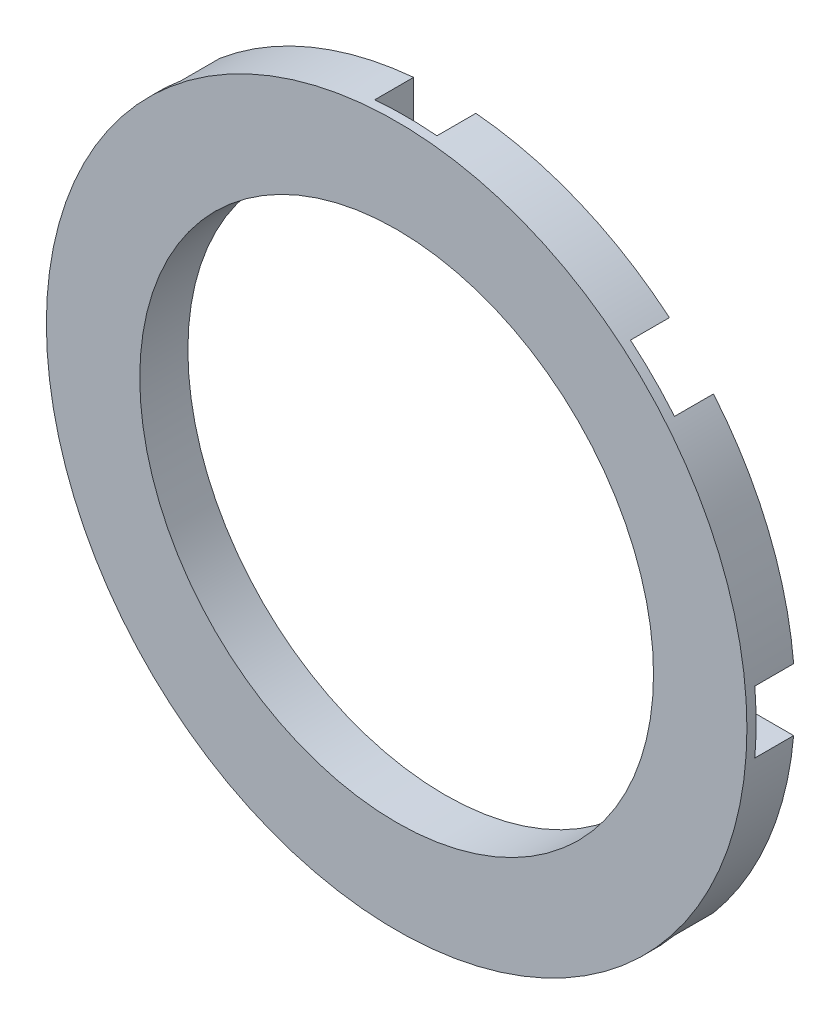
ISO-10303-21;
HEADER;
FILE_DESCRIPTION(('STEP AP214'),'2;1');
FILE_NAME('part.step','',(''),(''),'','','');
FILE_SCHEMA(('AUTOMOTIVE_DESIGN { 1 0 10303 214 1 1 1 1 }'));
ENDSEC;
DATA;
#1=APPLICATION_CONTEXT('core data for automotive mechanical design processes');
#2=APPLICATION_PROTOCOL_DEFINITION('international standard','automotive_design',2000,#1);
#3=PRODUCT_CONTEXT('',#1,'mechanical');
#4=PRODUCT('Part','Part','',(#3));
#5=PRODUCT_RELATED_PRODUCT_CATEGORY('part','',(#4));
#6=PRODUCT_DEFINITION_FORMATION('','',#4);
#7=PRODUCT_DEFINITION_CONTEXT('part definition',#1,'design');
#8=PRODUCT_DEFINITION('design','',#6,#7);
#9=PRODUCT_DEFINITION_SHAPE('','',#8);
#10=(LENGTH_UNIT() NAMED_UNIT(*) SI_UNIT(.MILLI.,.METRE.));
#11=(NAMED_UNIT(*) PLANE_ANGLE_UNIT() SI_UNIT($,.RADIAN.));
#12=(NAMED_UNIT(*) SI_UNIT($,.STERADIAN.) SOLID_ANGLE_UNIT());
#13=UNCERTAINTY_MEASURE_WITH_UNIT(LENGTH_MEASURE(1.E-05),#10,'distance_accuracy_value','');
#14=(GEOMETRIC_REPRESENTATION_CONTEXT(3) GLOBAL_UNCERTAINTY_ASSIGNED_CONTEXT((#13)) GLOBAL_UNIT_ASSIGNED_CONTEXT((#10,
#11,#12)) REPRESENTATION_CONTEXT('',''));
#15=CARTESIAN_POINT('',(0.,0.,0.));
#16=DIRECTION('',(0.,0.,1.));
#17=DIRECTION('',(1.,0.,0.));
#18=AXIS2_PLACEMENT_3D('',#15,#16,#17);
#19=CARTESIAN_POINT('',(0.,0.,-1.96215));
#20=DIRECTION('',(0.,0.,1.));
#21=DIRECTION('',(1.,0.,0.));
#22=AXIS2_PLACEMENT_3D('',#19,#20,#21);
#23=PLANE('',#22);
#24=CARTESIAN_POINT('',(0.,0.,-1.96215));
#25=DIRECTION('',(0.,0.,1.));
#26=DIRECTION('',(1.,0.,0.));
#27=AXIS2_PLACEMENT_3D('',#24,#25,#26);
#28=CIRCLE('',#27,28.575);
#29=CARTESIAN_POINT('',(18.3295422452963,21.9216446937245,-1.96215));
#30=VERTEX_POINT('',#29);
#31=CARTESIAN_POINT('',(2.54,28.461887235389,-1.96215));
#32=VERTEX_POINT('',#31);
#33=EDGE_CURVE('E48',#30,#32,#28,.T.);
#34=ORIENTED_EDGE('',*,*,#33,.F.);
#35=DIRECTION('',(0.707106781186539,0.707106781186556,0.));
#36=VECTOR('',#35,1.);
#37=CARTESIAN_POINT('',(20.2055762724053,23.7976787208335,-1.96215));
#38=LINE('',#37,#36);
#39=CARTESIAN_POINT('',(16.0744328207132,19.6665352691413,-1.96215));
#40=VERTEX_POINT('',#39);
#41=EDGE_CURVE('E254',#40,#30,#38,.T.);
#42=ORIENTED_EDGE('',*,*,#41,.F.);
#43=CARTESIAN_POINT('',(0.,0.,-1.96215));
#44=DIRECTION('',(0.,0.,-1.));
#45=DIRECTION('',(-1.,0.,0.));
#46=AXIS2_PLACEMENT_3D('',#43,#44,#45);
#47=CIRCLE('',#46,25.4);
#48=CARTESIAN_POINT('',(2.54,25.2726809025081,-1.96215));
#49=VERTEX_POINT('',#48);
#50=EDGE_CURVE('E263',#49,#40,#47,.T.);
#51=ORIENTED_EDGE('',*,*,#50,.F.);
#52=DIRECTION('',(0.,-1.,0.));
#53=VECTOR('',#52,1.);
#54=CARTESIAN_POINT('',(2.54,31.115,-1.96215));
#55=LINE('',#54,#53);
#56=EDGE_CURVE('E320',#32,#49,#55,.T.);
#57=ORIENTED_EDGE('',*,*,#56,.F.);
#58=EDGE_LOOP('',(#34,#42,#51,#57));
#59=FACE_BOUND('',#58,.T.);
#60=ADVANCED_FACE('F39',(#59),#23,.F.);
#61=CARTESIAN_POINT('',(0.,0.,1.21285));
#62=DIRECTION('',(0.,0.,-1.));
#63=DIRECTION('',(-1.,0.,0.));
#64=AXIS2_PLACEMENT_3D('',#61,#62,#63);
#65=CYLINDRICAL_SURFACE('',#64,25.4);
#66=ORIENTED_EDGE('',*,*,#50,.T.);
#67=DIRECTION('',(0.,0.,-1.));
#68=VECTOR('',#67,1.);
#69=CARTESIAN_POINT('',(16.0744328207132,19.6665352691413,1.21285));
#70=LINE('',#69,#68);
#71=CARTESIAN_POINT('',(16.0744328207132,19.6665352691413,1.21285));
#72=VERTEX_POINT('',#71);
#73=EDGE_CURVE('E248',#40,#72,#70,.F.);
#74=ORIENTED_EDGE('',*,*,#73,.T.);
#75=CARTESIAN_POINT('',(0.,0.,1.21285));
#76=DIRECTION('',(0.,0.,-1.));
#77=DIRECTION('',(-1.,0.,0.));
#78=AXIS2_PLACEMENT_3D('',#75,#76,#77);
#79=CIRCLE('',#78,25.4);
#80=CARTESIAN_POINT('',(2.54,25.2726809025081,1.21285));
#81=VERTEX_POINT('',#80);
#82=EDGE_CURVE('E261',#81,#72,#79,.T.);
#83=ORIENTED_EDGE('',*,*,#82,.F.);
#84=DIRECTION('',(0.,0.,-1.));
#85=VECTOR('',#84,1.);
#86=CARTESIAN_POINT('',(2.54,25.2726809025081,1.21285));
#87=LINE('',#86,#85);
#88=EDGE_CURVE('E311',#81,#49,#87,.T.);
#89=ORIENTED_EDGE('',*,*,#88,.T.);
#90=EDGE_LOOP('',(#66,#74,#83,#89));
#91=FACE_BOUND('',#90,.T.);
#92=ADVANCED_FACE('F259',(#91),#65,.F.);
#93=CARTESIAN_POINT('',(19.6665352691409,16.0744328207137,-1.96215));
#94=VERTEX_POINT('',#93);
#95=CARTESIAN_POINT('',(25.2726809025081,2.54000000000026,-1.96215));
#96=VERTEX_POINT('',#95);
#97=EDGE_CURVE('E286',#94,#96,#47,.T.);
#98=ORIENTED_EDGE('',*,*,#97,.F.);
#99=DIRECTION('',(-0.707106781186539,-0.707106781186556,0.));
#100=VECTOR('',#99,1.);
#101=CARTESIAN_POINT('',(23.797678720833,20.2055762724059,-1.96215));
#102=LINE('',#101,#100);
#103=CARTESIAN_POINT('',(21.921644693724,18.3295422452968,-1.96215));
#104=VERTEX_POINT('',#103);
#105=EDGE_CURVE('E472',#104,#94,#102,.T.);
#106=ORIENTED_EDGE('',*,*,#105,.F.);
#107=CARTESIAN_POINT('',(28.461887235389,2.5400000000003,-1.96215));
#108=VERTEX_POINT('',#107);
#109=EDGE_CURVE('E488',#108,#104,#28,.T.);
#110=ORIENTED_EDGE('',*,*,#109,.F.);
#111=DIRECTION('',(1.,0.,0.));
#112=VECTOR('',#111,1.);
#113=CARTESIAN_POINT('',(31.115,2.54000000000032,-1.96215));
#114=LINE('',#113,#112);
#115=EDGE_CURVE('E457',#96,#108,#114,.T.);
#116=ORIENTED_EDGE('',*,*,#115,.F.);
#117=EDGE_LOOP('',(#98,#106,#110,#116));
#118=FACE_BOUND('',#117,.T.);
#119=ADVANCED_FACE('F487',(#118),#23,.F.);
#120=CARTESIAN_POINT('',(19.6665352691409,16.0744328207137,1.21285));
#121=VERTEX_POINT('',#120);
#122=CARTESIAN_POINT('',(25.2726809025081,2.54000000000026,1.21285));
#123=VERTEX_POINT('',#122);
#124=EDGE_CURVE('E272',#121,#123,#79,.T.);
#125=ORIENTED_EDGE('',*,*,#124,.F.);
#126=DIRECTION('',(0.,0.,-1.));
#127=VECTOR('',#126,1.);
#128=CARTESIAN_POINT('',(19.6665352691409,16.0744328207137,1.21285));
#129=LINE('',#128,#127);
#130=EDGE_CURVE('E462',#121,#94,#129,.T.);
#131=ORIENTED_EDGE('',*,*,#130,.T.);
#132=ORIENTED_EDGE('',*,*,#97,.T.);
#133=DIRECTION('',(0.,0.,-1.));
#134=VECTOR('',#133,1.);
#135=CARTESIAN_POINT('',(25.2726809025081,2.54000000000026,1.21285));
#136=LINE('',#135,#134);
#137=EDGE_CURVE('E439',#96,#123,#136,.F.);
#138=ORIENTED_EDGE('',*,*,#137,.T.);
#139=EDGE_LOOP('',(#125,#131,#132,#138));
#140=FACE_BOUND('',#139,.T.);
#141=ADVANCED_FACE('F484',(#140),#65,.F.);
#142=CARTESIAN_POINT('',(25.2726809025082,-2.53999999999973,-1.96215));
#143=VERTEX_POINT('',#142);
#144=CARTESIAN_POINT('',(19.6665352691412,-16.0744328207133,-1.96215));
#145=VERTEX_POINT('',#144);
#146=EDGE_CURVE('E288',#143,#145,#47,.T.);
#147=ORIENTED_EDGE('',*,*,#146,.F.);
#148=DIRECTION('',(-1.,0.,0.));
#149=VECTOR('',#148,1.);
#150=CARTESIAN_POINT('',(31.115,-2.53999999999967,-1.96215));
#151=LINE('',#150,#149);
#152=CARTESIAN_POINT('',(28.461887235389,-2.5399999999997,-1.96215));
#153=VERTEX_POINT('',#152);
#154=EDGE_CURVE('E264',#153,#143,#151,.T.);
#155=ORIENTED_EDGE('',*,*,#154,.F.);
#156=CARTESIAN_POINT('',(21.9216446937244,-18.3295422452964,-1.96215));
#157=VERTEX_POINT('',#156);
#158=EDGE_CURVE('E541',#157,#153,#28,.T.);
#159=ORIENTED_EDGE('',*,*,#158,.F.);
#160=DIRECTION('',(0.707106781186553,-0.707106781186542,0.));
#161=VECTOR('',#160,1.);
#162=CARTESIAN_POINT('',(23.7976787208334,-20.2055762724054,-1.96215));
#163=LINE('',#162,#161);
#164=EDGE_CURVE('E435',#145,#157,#163,.T.);
#165=ORIENTED_EDGE('',*,*,#164,.F.);
#166=EDGE_LOOP('',(#147,#155,#159,#165));
#167=FACE_BOUND('',#166,.T.);
#168=ADVANCED_FACE('F507',(#167),#23,.F.);
#169=CARTESIAN_POINT('',(25.2726809025082,-2.53999999999973,1.21285));
#170=VERTEX_POINT('',#169);
#171=CARTESIAN_POINT('',(19.6665352691412,-16.0744328207133,1.21285));
#172=VERTEX_POINT('',#171);
#173=EDGE_CURVE('E278',#170,#172,#79,.T.);
#174=ORIENTED_EDGE('',*,*,#173,.F.);
#175=DIRECTION('',(0.,0.,-1.));
#176=VECTOR('',#175,1.);
#177=CARTESIAN_POINT('',(25.2726809025082,-2.53999999999973,1.21285));
#178=LINE('',#177,#176);
#179=EDGE_CURVE('E446',#170,#143,#178,.T.);
#180=ORIENTED_EDGE('',*,*,#179,.T.);
#181=ORIENTED_EDGE('',*,*,#146,.T.);
#182=DIRECTION('',(0.,0.,-1.));
#183=VECTOR('',#182,1.);
#184=CARTESIAN_POINT('',(19.6665352691412,-16.0744328207133,1.21285));
#185=LINE('',#184,#183);
#186=EDGE_CURVE('E415',#145,#172,#185,.F.);
#187=ORIENTED_EDGE('',*,*,#186,.T.);
#188=EDGE_LOOP('',(#174,#180,#181,#187));
#189=FACE_BOUND('',#188,.T.);
#190=ADVANCED_FACE('F503',(#189),#65,.F.);
#191=CARTESIAN_POINT('',(16.0744328207136,-19.666535269141,-1.96215));
#192=VERTEX_POINT('',#191);
#193=CARTESIAN_POINT('',(2.54,-25.2726809025081,-1.96215));
#194=VERTEX_POINT('',#193);
#195=EDGE_CURVE('E509',#192,#194,#47,.T.);
#196=ORIENTED_EDGE('',*,*,#195,.F.);
#197=DIRECTION('',(-0.707106781186553,0.707106781186542,0.));
#198=VECTOR('',#197,1.);
#199=CARTESIAN_POINT('',(20.2055762724058,-23.7976787208331,-1.96215));
#200=LINE('',#199,#198);
#201=CARTESIAN_POINT('',(18.3295422452968,-21.9216446937241,-1.96215));
#202=VERTEX_POINT('',#201);
#203=EDGE_CURVE('E437',#202,#192,#200,.T.);
#204=ORIENTED_EDGE('',*,*,#203,.F.);
#205=CARTESIAN_POINT('',(2.54,-28.461887235389,-1.96215));
#206=VERTEX_POINT('',#205);
#207=EDGE_CURVE('E536',#206,#202,#28,.T.);
#208=ORIENTED_EDGE('',*,*,#207,.F.);
#209=DIRECTION('',(0.,-1.,0.));
#210=VECTOR('',#209,1.);
#211=CARTESIAN_POINT('',(2.54,-31.115,-1.96215));
#212=LINE('',#211,#210);
#213=EDGE_CURVE('E411',#194,#206,#212,.T.);
#214=ORIENTED_EDGE('',*,*,#213,.F.);
#215=EDGE_LOOP('',(#196,#204,#208,#214));
#216=FACE_BOUND('',#215,.T.);
#217=ADVANCED_FACE('F582',(#216),#23,.F.);
#218=CARTESIAN_POINT('',(16.0744328207136,-19.666535269141,1.21285));
#219=VERTEX_POINT('',#218);
#220=CARTESIAN_POINT('',(2.54,-25.2726809025081,1.21285));
#221=VERTEX_POINT('',#220);
#222=EDGE_CURVE('E913',#219,#221,#79,.T.);
#223=ORIENTED_EDGE('',*,*,#222,.F.);
#224=DIRECTION('',(0.,0.,-1.));
#225=VECTOR('',#224,1.);
#226=CARTESIAN_POINT('',(16.0744328207136,-19.666535269141,1.21285));
#227=LINE('',#226,#225);
#228=EDGE_CURVE('E423',#219,#192,#227,.T.);
#229=ORIENTED_EDGE('',*,*,#228,.T.);
#230=ORIENTED_EDGE('',*,*,#195,.T.);
#231=DIRECTION('',(0.,0.,-1.));
#232=VECTOR('',#231,1.);
#233=CARTESIAN_POINT('',(2.54,-25.2726809025081,1.21285));
#234=LINE('',#233,#232);
#235=EDGE_CURVE('E391',#194,#221,#234,.F.);
#236=ORIENTED_EDGE('',*,*,#235,.T.);
#237=EDGE_LOOP('',(#223,#229,#230,#236));
#238=FACE_BOUND('',#237,.T.);
#239=ADVANCED_FACE('F586',(#238),#65,.F.);
#240=CARTESIAN_POINT('',(-2.54,-25.2726809025081,-1.96215));
#241=VERTEX_POINT('',#240);
#242=CARTESIAN_POINT('',(-16.0744328207133,-19.6665352691412,-1.96215));
#243=VERTEX_POINT('',#242);
#244=EDGE_CURVE('E510',#241,#243,#47,.T.);
#245=ORIENTED_EDGE('',*,*,#244,.F.);
#246=DIRECTION('',(0.,1.,0.));
#247=VECTOR('',#246,1.);
#248=CARTESIAN_POINT('',(-2.54,-31.115,-1.96215));
#249=LINE('',#248,#247);
#250=CARTESIAN_POINT('',(-2.54,-28.461887235389,-1.96215));
#251=VERTEX_POINT('',#250);
#252=EDGE_CURVE('E413',#251,#241,#249,.T.);
#253=ORIENTED_EDGE('',*,*,#252,.F.);
#254=CARTESIAN_POINT('',(-18.3295422452965,-21.9216446937243,-1.96215));
#255=VERTEX_POINT('',#254);
#256=EDGE_CURVE('E533',#255,#251,#28,.T.);
#257=ORIENTED_EDGE('',*,*,#256,.F.);
#258=DIRECTION('',(-0.707106781186544,-0.707106781186551,0.));
#259=VECTOR('',#258,1.);
#260=CARTESIAN_POINT('',(-20.2055762724055,-23.7976787208334,-1.96215));
#261=LINE('',#260,#259);
#262=EDGE_CURVE('E387',#243,#255,#261,.T.);
#263=ORIENTED_EDGE('',*,*,#262,.F.);
#264=EDGE_LOOP('',(#245,#253,#257,#263));
#265=FACE_BOUND('',#264,.T.);
#266=ADVANCED_FACE('F589',(#265),#23,.F.);
#267=CARTESIAN_POINT('',(-2.54,-25.2726809025081,1.21285));
#268=VERTEX_POINT('',#267);
#269=CARTESIAN_POINT('',(-16.0744328207133,-19.6665352691412,1.21285));
#270=VERTEX_POINT('',#269);
#271=EDGE_CURVE('E914',#268,#270,#79,.T.);
#272=ORIENTED_EDGE('',*,*,#271,.F.);
#273=DIRECTION('',(0.,0.,-1.));
#274=VECTOR('',#273,1.);
#275=CARTESIAN_POINT('',(-2.54,-25.2726809025081,1.21285));
#276=LINE('',#275,#274);
#277=EDGE_CURVE('E399',#268,#241,#276,.T.);
#278=ORIENTED_EDGE('',*,*,#277,.T.);
#279=ORIENTED_EDGE('',*,*,#244,.T.);
#280=DIRECTION('',(0.,0.,-1.));
#281=VECTOR('',#280,1.);
#282=CARTESIAN_POINT('',(-16.0744328207133,-19.6665352691412,1.21285));
#283=LINE('',#282,#281);
#284=EDGE_CURVE('E367',#243,#270,#283,.F.);
#285=ORIENTED_EDGE('',*,*,#284,.T.);
#286=EDGE_LOOP('',(#272,#278,#279,#285));
#287=FACE_BOUND('',#286,.T.);
#288=ADVANCED_FACE('F593',(#287),#65,.F.);
#289=CARTESIAN_POINT('',(-19.666535269141,-16.0744328207135,-1.96215));
#290=VERTEX_POINT('',#289);
#291=CARTESIAN_POINT('',(-25.2726809025081,-2.54000000000009,-1.96215));
#292=VERTEX_POINT('',#291);
#293=EDGE_CURVE('E296',#290,#292,#47,.T.);
#294=ORIENTED_EDGE('',*,*,#293,.F.);
#295=DIRECTION('',(0.707106781186544,0.707106781186551,0.));
#296=VECTOR('',#295,1.);
#297=CARTESIAN_POINT('',(-23.7976787208332,-20.2055762724057,-1.96215));
#298=LINE('',#297,#296);
#299=CARTESIAN_POINT('',(-21.9216446937241,-18.3295422452967,-1.96215));
#300=VERTEX_POINT('',#299);
#301=EDGE_CURVE('E389',#300,#290,#298,.T.);
#302=ORIENTED_EDGE('',*,*,#301,.F.);
#303=CARTESIAN_POINT('',(-28.461887235389,-2.5400000000001,-1.96215));
#304=VERTEX_POINT('',#303);
#305=EDGE_CURVE('E531',#304,#300,#28,.T.);
#306=ORIENTED_EDGE('',*,*,#305,.F.);
#307=DIRECTION('',(-1.,0.,0.));
#308=VECTOR('',#307,1.);
#309=CARTESIAN_POINT('',(-31.115,-2.54000000000011,-1.96215));
#310=LINE('',#309,#308);
#311=EDGE_CURVE('E363',#292,#304,#310,.T.);
#312=ORIENTED_EDGE('',*,*,#311,.F.);
#313=EDGE_LOOP('',(#294,#302,#306,#312));
#314=FACE_BOUND('',#313,.T.);
#315=ADVANCED_FACE('F529',(#314),#23,.F.);
#316=CARTESIAN_POINT('',(-19.666535269141,-16.0744328207135,1.21285));
#317=VERTEX_POINT('',#316);
#318=CARTESIAN_POINT('',(-25.2726809025081,-2.54000000000009,1.21285));
#319=VERTEX_POINT('',#318);
#320=EDGE_CURVE('E285',#317,#319,#79,.T.);
#321=ORIENTED_EDGE('',*,*,#320,.F.);
#322=DIRECTION('',(0.,0.,-1.));
#323=VECTOR('',#322,1.);
#324=CARTESIAN_POINT('',(-19.666535269141,-16.0744328207135,1.21285));
#325=LINE('',#324,#323);
#326=EDGE_CURVE('E375',#317,#290,#325,.T.);
#327=ORIENTED_EDGE('',*,*,#326,.T.);
#328=ORIENTED_EDGE('',*,*,#293,.T.);
#329=DIRECTION('',(0.,0.,-1.));
#330=VECTOR('',#329,1.);
#331=CARTESIAN_POINT('',(-25.2726809025081,-2.54000000000009,1.21285));
#332=LINE('',#331,#330);
#333=EDGE_CURVE('E343',#292,#319,#332,.F.);
#334=ORIENTED_EDGE('',*,*,#333,.T.);
#335=EDGE_LOOP('',(#321,#327,#328,#334));
#336=FACE_BOUND('',#335,.T.);
#337=ADVANCED_FACE('F521',(#336),#65,.F.);
#338=CARTESIAN_POINT('',(-25.2726809025082,2.53999999999991,-1.96215));
#339=VERTEX_POINT('',#338);
#340=CARTESIAN_POINT('',(-19.6665352691411,16.0744328207134,-1.96215));
#341=VERTEX_POINT('',#340);
#342=EDGE_CURVE('E289',#339,#341,#47,.T.);
#343=ORIENTED_EDGE('',*,*,#342,.F.);
#344=DIRECTION('',(1.,0.,0.));
#345=VECTOR('',#344,1.);
#346=CARTESIAN_POINT('',(-31.115,2.53999999999989,-1.96215));
#347=LINE('',#346,#345);
#348=CARTESIAN_POINT('',(-28.461887235389,2.5399999999999,-1.96215));
#349=VERTEX_POINT('',#348);
#350=EDGE_CURVE('E365',#349,#339,#347,.T.);
#351=ORIENTED_EDGE('',*,*,#350,.F.);
#352=CARTESIAN_POINT('',(-21.9216446937243,18.3295422452965,-1.96215));
#353=VERTEX_POINT('',#352);
#354=EDGE_CURVE('E47',#353,#349,#28,.T.);
#355=ORIENTED_EDGE('',*,*,#354,.F.);
#356=DIRECTION('',(-0.707106781186549,0.707106781186547,0.));
#357=VECTOR('',#356,1.);
#358=CARTESIAN_POINT('',(-23.7976787208333,20.2055762724056,-1.96215));
#359=LINE('',#358,#357);
#360=EDGE_CURVE('E339',#341,#353,#359,.T.);
#361=ORIENTED_EDGE('',*,*,#360,.F.);
#362=EDGE_LOOP('',(#343,#351,#355,#361));
#363=FACE_BOUND('',#362,.T.);
#364=ADVANCED_FACE('F568',(#363),#23,.F.);
#365=CARTESIAN_POINT('',(-25.2726809025082,2.53999999999991,1.21285));
#366=VERTEX_POINT('',#365);
#367=CARTESIAN_POINT('',(-19.6665352691411,16.0744328207134,1.21285));
#368=VERTEX_POINT('',#367);
#369=EDGE_CURVE('E281',#366,#368,#79,.T.);
#370=ORIENTED_EDGE('',*,*,#369,.F.);
#371=DIRECTION('',(0.,0.,-1.));
#372=VECTOR('',#371,1.);
#373=CARTESIAN_POINT('',(-25.2726809025082,2.53999999999991,1.21285));
#374=LINE('',#373,#372);
#375=EDGE_CURVE('E351',#366,#339,#374,.T.);
#376=ORIENTED_EDGE('',*,*,#375,.T.);
#377=ORIENTED_EDGE('',*,*,#342,.T.);
#378=DIRECTION('',(0.,0.,-1.));
#379=VECTOR('',#378,1.);
#380=CARTESIAN_POINT('',(-19.6665352691411,16.0744328207134,1.21285));
#381=LINE('',#380,#379);
#382=EDGE_CURVE('E325',#341,#368,#381,.F.);
#383=ORIENTED_EDGE('',*,*,#382,.T.);
#384=EDGE_LOOP('',(#370,#376,#377,#383));
#385=FACE_BOUND('',#384,.T.);
#386=ADVANCED_FACE('F567',(#385),#65,.F.);
#387=CARTESIAN_POINT('',(0.,0.,-1.96215));
#388=DIRECTION('',(0.,0.,1.));
#389=DIRECTION('',(1.,0.,0.));
#390=AXIS2_PLACEMENT_3D('',#387,#388,#389);
#391=CIRCLE('',#390,20.955);
#392=CARTESIAN_POINT('',(20.955,0.,-1.96215));
#393=VERTEX_POINT('',#392);
#394=EDGE_CURVE('E546',#393,#393,#391,.T.);
#395=ORIENTED_EDGE('',*,*,#394,.T.);
#396=EDGE_LOOP('',(#395));
#397=FACE_BOUND('',#396,.T.);
#398=CARTESIAN_POINT('',(0.,0.,-1.96215));
#399=DIRECTION('',(0.,0.,-1.));
#400=DIRECTION('',(-1.,0.,0.));
#401=AXIS2_PLACEMENT_3D('',#398,#399,#400);
#402=CIRCLE('',#401,22.225);
#403=CARTESIAN_POINT('',(-22.225,0.,-1.96215));
#404=VERTEX_POINT('',#403);
#405=EDGE_CURVE('E298',#404,#404,#402,.T.);
#406=ORIENTED_EDGE('',*,*,#405,.T.);
#407=EDGE_LOOP('',(#406));
#408=FACE_BOUND('',#407,.T.);
#409=ADVANCED_FACE('F560',(#397,#408),#23,.F.);
#410=CARTESIAN_POINT('',(0.,0.,-1.96215));
#411=DIRECTION('',(0.,0.,1.));
#412=DIRECTION('',(1.,0.,0.));
#413=AXIS2_PLACEMENT_3D('',#410,#411,#412);
#414=CYLINDRICAL_SURFACE('',#413,28.575);
#415=DIRECTION('',(0.,0.,1.));
#416=VECTOR('',#415,1.);
#417=CARTESIAN_POINT('',(18.3295422452963,21.9216446937245,-1.96215));
#418=LINE('',#417,#416);
#419=CARTESIAN_POINT('',(18.3295422452963,21.9216446937245,1.21285));
#420=VERTEX_POINT('',#419);
#421=EDGE_CURVE('E251',#30,#420,#418,.T.);
#422=ORIENTED_EDGE('',*,*,#421,.F.);
#423=ORIENTED_EDGE('',*,*,#33,.T.);
#424=DIRECTION('',(0.,0.,1.));
#425=VECTOR('',#424,1.);
#426=CARTESIAN_POINT('',(2.54,28.461887235389,-1.96215));
#427=LINE('',#426,#425);
#428=CARTESIAN_POINT('',(2.54,28.461887235389,1.21285));
#429=VERTEX_POINT('',#428);
#430=EDGE_CURVE('E308',#429,#32,#427,.F.);
#431=ORIENTED_EDGE('',*,*,#430,.F.);
#432=CARTESIAN_POINT('',(0.,0.,1.21285));
#433=DIRECTION('',(0.,0.,-1.));
#434=DIRECTION('',(-1.,0.,0.));
#435=AXIS2_PLACEMENT_3D('',#432,#433,#434);
#436=CIRCLE('',#435,28.575);
#437=CARTESIAN_POINT('',(-2.54,28.461887235389,1.21285));
#438=VERTEX_POINT('',#437);
#439=EDGE_CURVE('E313',#429,#438,#436,.F.);
#440=ORIENTED_EDGE('',*,*,#439,.T.);
#441=DIRECTION('',(0.,0.,1.));
#442=VECTOR('',#441,1.);
#443=CARTESIAN_POINT('',(-2.54,28.461887235389,-1.96215));
#444=LINE('',#443,#442);
#445=CARTESIAN_POINT('',(-2.54,28.461887235389,-1.96215));
#446=VERTEX_POINT('',#445);
#447=EDGE_CURVE('E303',#446,#438,#444,.T.);
#448=ORIENTED_EDGE('',*,*,#447,.F.);
#449=CARTESIAN_POINT('',(-18.3295422452966,21.9216446937242,-1.96215));
#450=VERTEX_POINT('',#449);
#451=EDGE_CURVE('E11',#446,#450,#28,.T.);
#452=ORIENTED_EDGE('',*,*,#451,.T.);
#453=DIRECTION('',(0.,0.,1.));
#454=VECTOR('',#453,1.);
#455=CARTESIAN_POINT('',(-18.3295422452966,21.9216446937242,-1.96215));
#456=LINE('',#455,#454);
#457=CARTESIAN_POINT('',(-18.3295422452966,21.9216446937242,1.21285));
#458=VERTEX_POINT('',#457);
#459=EDGE_CURVE('E328',#458,#450,#456,.F.);
#460=ORIENTED_EDGE('',*,*,#459,.F.);
#461=CARTESIAN_POINT('',(0.,0.,1.21285));
#462=DIRECTION('',(0.,0.,-1.));
#463=DIRECTION('',(-1.,0.,0.));
#464=AXIS2_PLACEMENT_3D('',#461,#462,#463);
#465=CIRCLE('',#464,28.575);
#466=CARTESIAN_POINT('',(-21.9216446937243,18.3295422452965,1.21285));
#467=VERTEX_POINT('',#466);
#468=EDGE_CURVE('E332',#458,#467,#465,.F.);
#469=ORIENTED_EDGE('',*,*,#468,.T.);
#470=DIRECTION('',(0.,0.,1.));
#471=VECTOR('',#470,1.);
#472=CARTESIAN_POINT('',(-21.9216446937243,18.3295422452965,-1.96215));
#473=LINE('',#472,#471);
#474=EDGE_CURVE('E322',#353,#467,#473,.T.);
#475=ORIENTED_EDGE('',*,*,#474,.F.);
#476=ORIENTED_EDGE('',*,*,#354,.T.);
#477=DIRECTION('',(0.,0.,1.));
#478=VECTOR('',#477,1.);
#479=CARTESIAN_POINT('',(-28.461887235389,2.5399999999999,-1.96215));
#480=LINE('',#479,#478);
#481=CARTESIAN_POINT('',(-28.461887235389,2.5399999999999,1.21285));
#482=VERTEX_POINT('',#481);
#483=EDGE_CURVE('E354',#482,#349,#480,.F.);
#484=ORIENTED_EDGE('',*,*,#483,.F.);
#485=CARTESIAN_POINT('',(0.,0.,1.21285));
#486=DIRECTION('',(0.,0.,-1.));
#487=DIRECTION('',(-1.,0.,0.));
#488=AXIS2_PLACEMENT_3D('',#485,#486,#487);
#489=CIRCLE('',#488,28.575);
#490=CARTESIAN_POINT('',(-28.461887235389,-2.5400000000001,1.21285));
#491=VERTEX_POINT('',#490);
#492=EDGE_CURVE('E356',#482,#491,#489,.F.);
#493=ORIENTED_EDGE('',*,*,#492,.T.);
#494=DIRECTION('',(0.,0.,1.));
#495=VECTOR('',#494,1.);
#496=CARTESIAN_POINT('',(-28.461887235389,-2.5400000000001,-1.96215));
#497=LINE('',#496,#495);
#498=EDGE_CURVE('E348',#304,#491,#497,.T.);
#499=ORIENTED_EDGE('',*,*,#498,.F.);
#500=ORIENTED_EDGE('',*,*,#305,.T.);
#501=DIRECTION('',(0.,0.,1.));
#502=VECTOR('',#501,1.);
#503=CARTESIAN_POINT('',(-21.9216446937241,-18.3295422452967,-1.96215));
#504=LINE('',#503,#502);
#505=CARTESIAN_POINT('',(-21.9216446937241,-18.3295422452967,1.21285));
#506=VERTEX_POINT('',#505);
#507=EDGE_CURVE('E378',#506,#300,#504,.F.);
#508=ORIENTED_EDGE('',*,*,#507,.F.);
#509=CARTESIAN_POINT('',(0.,0.,1.21285));
#510=DIRECTION('',(0.,0.,-1.));
#511=DIRECTION('',(-1.,0.,0.));
#512=AXIS2_PLACEMENT_3D('',#509,#510,#511);
#513=CIRCLE('',#512,28.575);
#514=CARTESIAN_POINT('',(-18.3295422452965,-21.9216446937243,1.21285));
#515=VERTEX_POINT('',#514);
#516=EDGE_CURVE('E380',#506,#515,#513,.F.);
#517=ORIENTED_EDGE('',*,*,#516,.T.);
#518=DIRECTION('',(0.,0.,1.));
#519=VECTOR('',#518,1.);
#520=CARTESIAN_POINT('',(-18.3295422452965,-21.9216446937243,-1.96215));
#521=LINE('',#520,#519);
#522=EDGE_CURVE('E372',#255,#515,#521,.T.);
#523=ORIENTED_EDGE('',*,*,#522,.F.);
#524=ORIENTED_EDGE('',*,*,#256,.T.);
#525=DIRECTION('',(0.,0.,1.));
#526=VECTOR('',#525,1.);
#527=CARTESIAN_POINT('',(-2.54,-28.461887235389,-1.96215));
#528=LINE('',#527,#526);
#529=CARTESIAN_POINT('',(-2.54,-28.461887235389,1.21285));
#530=VERTEX_POINT('',#529);
#531=EDGE_CURVE('E402',#530,#251,#528,.F.);
#532=ORIENTED_EDGE('',*,*,#531,.F.);
#533=CARTESIAN_POINT('',(0.,0.,1.21285));
#534=DIRECTION('',(0.,0.,-1.));
#535=DIRECTION('',(-1.,0.,0.));
#536=AXIS2_PLACEMENT_3D('',#533,#534,#535);
#537=CIRCLE('',#536,28.575);
#538=CARTESIAN_POINT('',(2.54,-28.461887235389,1.21285));
#539=VERTEX_POINT('',#538);
#540=EDGE_CURVE('E404',#530,#539,#537,.F.);
#541=ORIENTED_EDGE('',*,*,#540,.T.);
#542=DIRECTION('',(0.,0.,1.));
#543=VECTOR('',#542,1.);
#544=CARTESIAN_POINT('',(2.54,-28.461887235389,-1.96215));
#545=LINE('',#544,#543);
#546=EDGE_CURVE('E396',#206,#539,#545,.T.);
#547=ORIENTED_EDGE('',*,*,#546,.F.);
#548=ORIENTED_EDGE('',*,*,#207,.T.);
#549=DIRECTION('',(0.,0.,1.));
#550=VECTOR('',#549,1.);
#551=CARTESIAN_POINT('',(18.3295422452968,-21.9216446937241,-1.96215));
#552=LINE('',#551,#550);
#553=CARTESIAN_POINT('',(18.3295422452968,-21.9216446937241,1.21285));
#554=VERTEX_POINT('',#553);
#555=EDGE_CURVE('E426',#554,#202,#552,.F.);
#556=ORIENTED_EDGE('',*,*,#555,.F.);
#557=CARTESIAN_POINT('',(0.,0.,1.21285));
#558=DIRECTION('',(0.,0.,-1.));
#559=DIRECTION('',(-1.,0.,0.));
#560=AXIS2_PLACEMENT_3D('',#557,#558,#559);
#561=CIRCLE('',#560,28.575);
#562=CARTESIAN_POINT('',(21.9216446937244,-18.3295422452964,1.21285));
#563=VERTEX_POINT('',#562);
#564=EDGE_CURVE('E428',#554,#563,#561,.F.);
#565=ORIENTED_EDGE('',*,*,#564,.T.);
#566=DIRECTION('',(0.,0.,1.));
#567=VECTOR('',#566,1.);
#568=CARTESIAN_POINT('',(21.9216446937244,-18.3295422452964,-1.96215));
#569=LINE('',#568,#567);
#570=EDGE_CURVE('E420',#157,#563,#569,.T.);
#571=ORIENTED_EDGE('',*,*,#570,.F.);
#572=ORIENTED_EDGE('',*,*,#158,.T.);
#573=DIRECTION('',(0.,0.,1.));
#574=VECTOR('',#573,1.);
#575=CARTESIAN_POINT('',(28.461887235389,-2.5399999999997,-1.96215));
#576=LINE('',#575,#574);
#577=CARTESIAN_POINT('',(28.461887235389,-2.5399999999997,1.21285));
#578=VERTEX_POINT('',#577);
#579=EDGE_CURVE('E449',#578,#153,#576,.F.);
#580=ORIENTED_EDGE('',*,*,#579,.F.);
#581=CARTESIAN_POINT('',(0.,0.,1.21285));
#582=DIRECTION('',(0.,0.,-1.));
#583=DIRECTION('',(-1.,0.,0.));
#584=AXIS2_PLACEMENT_3D('',#581,#582,#583);
#585=CIRCLE('',#584,28.575);
#586=CARTESIAN_POINT('',(28.461887235389,2.5400000000003,1.21285));
#587=VERTEX_POINT('',#586);
#588=EDGE_CURVE('E451',#578,#587,#585,.F.);
#589=ORIENTED_EDGE('',*,*,#588,.T.);
#590=DIRECTION('',(0.,0.,1.));
#591=VECTOR('',#590,1.);
#592=CARTESIAN_POINT('',(28.461887235389,2.5400000000003,-1.96215));
#593=LINE('',#592,#591);
#594=EDGE_CURVE('E444',#108,#587,#593,.T.);
#595=ORIENTED_EDGE('',*,*,#594,.F.);
#596=ORIENTED_EDGE('',*,*,#109,.T.);
#597=DIRECTION('',(0.,0.,1.));
#598=VECTOR('',#597,1.);
#599=CARTESIAN_POINT('',(21.921644693724,18.3295422452968,-1.96215));
#600=LINE('',#599,#598);
#601=CARTESIAN_POINT('',(21.921644693724,18.3295422452968,1.21285));
#602=VERTEX_POINT('',#601);
#603=EDGE_CURVE('E465',#602,#104,#600,.F.);
#604=ORIENTED_EDGE('',*,*,#603,.F.);
#605=CARTESIAN_POINT('',(0.,0.,1.21285));
#606=DIRECTION('',(0.,0.,-1.));
#607=DIRECTION('',(-1.,0.,0.));
#608=AXIS2_PLACEMENT_3D('',#605,#606,#607);
#609=CIRCLE('',#608,28.575);
#610=EDGE_CURVE('E467',#602,#420,#609,.F.);
#611=ORIENTED_EDGE('',*,*,#610,.T.);
#612=EDGE_LOOP('',(#422,#423,#431,#440,#448,#452,#460,#469,#475,#476,#484,#493,#499,#500,#508,
#517,#523,#524,#532,#541,#547,#548,#556,#565,#571,#572,#580,#589,#595,#596,#604,#611));
#613=FACE_BOUND('',#612,.T.);
#614=CARTESIAN_POINT('',(0.,0.,1.96215));
#615=DIRECTION('',(0.,0.,1.));
#616=DIRECTION('',(1.,0.,0.));
#617=AXIS2_PLACEMENT_3D('',#614,#615,#616);
#618=CIRCLE('',#617,28.575);
#619=CARTESIAN_POINT('',(28.575,0.,1.96215));
#620=VERTEX_POINT('',#619);
#621=EDGE_CURVE('E276',#620,#620,#618,.T.);
#622=ORIENTED_EDGE('',*,*,#621,.F.);
#623=EDGE_LOOP('',(#622));
#624=FACE_BOUND('',#623,.T.);
#625=ADVANCED_FACE('F41',(#613,#624),#414,.T.);
#626=CARTESIAN_POINT('',(-16.0744328207135,19.6665352691411,-1.96215));
#627=VERTEX_POINT('',#626);
#628=CARTESIAN_POINT('',(-2.54,25.2726809025081,-1.96215));
#629=VERTEX_POINT('',#628);
#630=EDGE_CURVE('E287',#627,#629,#47,.T.);
#631=ORIENTED_EDGE('',*,*,#630,.F.);
#632=DIRECTION('',(0.707106781186549,-0.707106781186547,0.));
#633=VECTOR('',#632,1.);
#634=CARTESIAN_POINT('',(-20.2055762724056,23.7976787208332,-1.96215));
#635=LINE('',#634,#633);
#636=EDGE_CURVE('E341',#450,#627,#635,.T.);
#637=ORIENTED_EDGE('',*,*,#636,.F.);
#638=ORIENTED_EDGE('',*,*,#451,.F.);
#639=DIRECTION('',(0.,1.,0.));
#640=VECTOR('',#639,1.);
#641=CARTESIAN_POINT('',(-2.54,31.115,-1.96215));
#642=LINE('',#641,#640);
#643=EDGE_CURVE('E318',#629,#446,#642,.T.);
#644=ORIENTED_EDGE('',*,*,#643,.F.);
#645=EDGE_LOOP('',(#631,#637,#638,#644));
#646=FACE_BOUND('',#645,.T.);
#647=ADVANCED_FACE('F559',(#646),#23,.F.);
#648=CARTESIAN_POINT('',(0.,0.,-1.96215));
#649=DIRECTION('',(0.,0.,1.));
#650=DIRECTION('',(1.,0.,0.));
#651=AXIS2_PLACEMENT_3D('',#648,#649,#650);
#652=CYLINDRICAL_SURFACE('',#651,20.955);
#653=ORIENTED_EDGE('',*,*,#394,.F.);
#654=EDGE_LOOP('',(#653));
#655=FACE_BOUND('',#654,.T.);
#656=CARTESIAN_POINT('',(0.,0.,1.96215));
#657=DIRECTION('',(0.,0.,1.));
#658=DIRECTION('',(1.,0.,0.));
#659=AXIS2_PLACEMENT_3D('',#656,#657,#658);
#660=CIRCLE('',#659,20.955);
#661=CARTESIAN_POINT('',(20.955,0.,1.96215));
#662=VERTEX_POINT('',#661);
#663=EDGE_CURVE('E271',#662,#662,#660,.T.);
#664=ORIENTED_EDGE('',*,*,#663,.T.);
#665=EDGE_LOOP('',(#664));
#666=FACE_BOUND('',#665,.T.);
#667=ADVANCED_FACE('F565',(#655,#666),#652,.F.);
#668=CARTESIAN_POINT('',(0.,0.,1.96215));
#669=DIRECTION('',(0.,0.,1.));
#670=DIRECTION('',(1.,0.,0.));
#671=AXIS2_PLACEMENT_3D('',#668,#669,#670);
#672=PLANE('',#671);
#673=ORIENTED_EDGE('',*,*,#621,.T.);
#674=EDGE_LOOP('',(#673));
#675=FACE_BOUND('',#674,.T.);
#676=ORIENTED_EDGE('',*,*,#663,.F.);
#677=EDGE_LOOP('',(#676));
#678=FACE_BOUND('',#677,.T.);
#679=ADVANCED_FACE('F556',(#675,#678),#672,.T.);
#680=CARTESIAN_POINT('',(-16.0744328207135,19.6665352691411,1.21285));
#681=VERTEX_POINT('',#680);
#682=CARTESIAN_POINT('',(-2.54,25.2726809025081,1.21285));
#683=VERTEX_POINT('',#682);
#684=EDGE_CURVE('E274',#681,#683,#79,.T.);
#685=ORIENTED_EDGE('',*,*,#684,.F.);
#686=DIRECTION('',(0.,0.,-1.));
#687=VECTOR('',#686,1.);
#688=CARTESIAN_POINT('',(-16.0744328207135,19.6665352691411,1.21285));
#689=LINE('',#688,#687);
#690=EDGE_CURVE('E330',#681,#627,#689,.T.);
#691=ORIENTED_EDGE('',*,*,#690,.T.);
#692=ORIENTED_EDGE('',*,*,#630,.T.);
#693=DIRECTION('',(0.,0.,-1.));
#694=VECTOR('',#693,1.);
#695=CARTESIAN_POINT('',(-2.54,25.2726809025081,1.21285));
#696=LINE('',#695,#694);
#697=EDGE_CURVE('E306',#629,#683,#696,.F.);
#698=ORIENTED_EDGE('',*,*,#697,.T.);
#699=EDGE_LOOP('',(#685,#691,#692,#698));
#700=FACE_BOUND('',#699,.T.);
#701=ADVANCED_FACE('F575',(#700),#65,.F.);
#702=CARTESIAN_POINT('',(0.,0.,1.21285));
#703=DIRECTION('',(0.,0.,-1.));
#704=DIRECTION('',(-1.,0.,0.));
#705=AXIS2_PLACEMENT_3D('',#702,#703,#704);
#706=PLANE('',#705);
#707=ORIENTED_EDGE('',*,*,#82,.T.);
#708=DIRECTION('',(-0.707106781186539,-0.707106781186556,0.));
#709=VECTOR('',#708,1.);
#710=CARTESIAN_POINT('',(20.2055762724053,23.7976787208335,1.21285));
#711=LINE('',#710,#709);
#712=EDGE_CURVE('E55',#420,#72,#711,.T.);
#713=ORIENTED_EDGE('',*,*,#712,.F.);
#714=ORIENTED_EDGE('',*,*,#610,.F.);
#715=DIRECTION('',(0.707106781186539,0.707106781186556,0.));
#716=VECTOR('',#715,1.);
#717=CARTESIAN_POINT('',(23.797678720833,20.2055762724059,1.21285));
#718=LINE('',#717,#716);
#719=EDGE_CURVE('E253',#121,#602,#718,.T.);
#720=ORIENTED_EDGE('',*,*,#719,.F.);
#721=ORIENTED_EDGE('',*,*,#124,.T.);
#722=DIRECTION('',(-1.,0.,0.));
#723=VECTOR('',#722,1.);
#724=CARTESIAN_POINT('',(31.115,2.54000000000032,1.21285));
#725=LINE('',#724,#723);
#726=EDGE_CURVE('E62',#587,#123,#725,.T.);
#727=ORIENTED_EDGE('',*,*,#726,.F.);
#728=ORIENTED_EDGE('',*,*,#588,.F.);
#729=DIRECTION('',(1.,0.,0.));
#730=VECTOR('',#729,1.);
#731=CARTESIAN_POINT('',(31.115,-2.53999999999967,1.21285));
#732=LINE('',#731,#730);
#733=EDGE_CURVE('E454',#170,#578,#732,.T.);
#734=ORIENTED_EDGE('',*,*,#733,.F.);
#735=ORIENTED_EDGE('',*,*,#173,.T.);
#736=DIRECTION('',(-0.707106781186553,0.707106781186542,0.));
#737=VECTOR('',#736,1.);
#738=CARTESIAN_POINT('',(23.7976787208334,-20.2055762724054,1.21285));
#739=LINE('',#738,#737);
#740=EDGE_CURVE('E434',#563,#172,#739,.T.);
#741=ORIENTED_EDGE('',*,*,#740,.F.);
#742=ORIENTED_EDGE('',*,*,#564,.F.);
#743=DIRECTION('',(0.707106781186553,-0.707106781186542,0.));
#744=VECTOR('',#743,1.);
#745=CARTESIAN_POINT('',(20.2055762724058,-23.7976787208331,1.21285));
#746=LINE('',#745,#744);
#747=EDGE_CURVE('E431',#219,#554,#746,.T.);
#748=ORIENTED_EDGE('',*,*,#747,.F.);
#749=ORIENTED_EDGE('',*,*,#222,.T.);
#750=DIRECTION('',(0.,1.,0.));
#751=VECTOR('',#750,1.);
#752=CARTESIAN_POINT('',(2.54,-31.115,1.21285));
#753=LINE('',#752,#751);
#754=EDGE_CURVE('E410',#539,#221,#753,.T.);
#755=ORIENTED_EDGE('',*,*,#754,.F.);
#756=ORIENTED_EDGE('',*,*,#540,.F.);
#757=DIRECTION('',(0.,-1.,0.));
#758=VECTOR('',#757,1.);
#759=CARTESIAN_POINT('',(-2.54,-31.115,1.21285));
#760=LINE('',#759,#758);
#761=EDGE_CURVE('E407',#268,#530,#760,.T.);
#762=ORIENTED_EDGE('',*,*,#761,.F.);
#763=ORIENTED_EDGE('',*,*,#271,.T.);
#764=DIRECTION('',(0.707106781186544,0.707106781186551,0.));
#765=VECTOR('',#764,1.);
#766=CARTESIAN_POINT('',(-20.2055762724055,-23.7976787208334,1.21285));
#767=LINE('',#766,#765);
#768=EDGE_CURVE('E386',#515,#270,#767,.T.);
#769=ORIENTED_EDGE('',*,*,#768,.F.);
#770=ORIENTED_EDGE('',*,*,#516,.F.);
#771=DIRECTION('',(-0.707106781186544,-0.707106781186551,0.));
#772=VECTOR('',#771,1.);
#773=CARTESIAN_POINT('',(-23.7976787208332,-20.2055762724057,1.21285));
#774=LINE('',#773,#772);
#775=EDGE_CURVE('E383',#317,#506,#774,.T.);
#776=ORIENTED_EDGE('',*,*,#775,.F.);
#777=ORIENTED_EDGE('',*,*,#320,.T.);
#778=DIRECTION('',(1.,0.,0.));
#779=VECTOR('',#778,1.);
#780=CARTESIAN_POINT('',(-31.115,-2.54000000000011,1.21285));
#781=LINE('',#780,#779);
#782=EDGE_CURVE('E362',#491,#319,#781,.T.);
#783=ORIENTED_EDGE('',*,*,#782,.F.);
#784=ORIENTED_EDGE('',*,*,#492,.F.);
#785=DIRECTION('',(-1.,0.,0.));
#786=VECTOR('',#785,1.);
#787=CARTESIAN_POINT('',(-31.115,2.53999999999989,1.21285));
#788=LINE('',#787,#786);
#789=EDGE_CURVE('E359',#366,#482,#788,.T.);
#790=ORIENTED_EDGE('',*,*,#789,.F.);
#791=ORIENTED_EDGE('',*,*,#369,.T.);
#792=DIRECTION('',(0.707106781186549,-0.707106781186547,0.));
#793=VECTOR('',#792,1.);
#794=CARTESIAN_POINT('',(-23.7976787208333,20.2055762724056,1.21285));
#795=LINE('',#794,#793);
#796=EDGE_CURVE('E338',#467,#368,#795,.T.);
#797=ORIENTED_EDGE('',*,*,#796,.F.);
#798=ORIENTED_EDGE('',*,*,#468,.F.);
#799=DIRECTION('',(-0.707106781186549,0.707106781186547,0.));
#800=VECTOR('',#799,1.);
#801=CARTESIAN_POINT('',(-20.2055762724056,23.7976787208332,1.21285));
#802=LINE('',#801,#800);
#803=EDGE_CURVE('E335',#681,#458,#802,.T.);
#804=ORIENTED_EDGE('',*,*,#803,.F.);
#805=ORIENTED_EDGE('',*,*,#684,.T.);
#806=DIRECTION('',(0.,-1.,0.));
#807=VECTOR('',#806,1.);
#808=CARTESIAN_POINT('',(-2.54,31.115,1.21285));
#809=LINE('',#808,#807);
#810=EDGE_CURVE('E317',#438,#683,#809,.T.);
#811=ORIENTED_EDGE('',*,*,#810,.F.);
#812=ORIENTED_EDGE('',*,*,#439,.F.);
#813=DIRECTION('',(0.,1.,0.));
#814=VECTOR('',#813,1.);
#815=CARTESIAN_POINT('',(2.54,31.115,1.21285));
#816=LINE('',#815,#814);
#817=EDGE_CURVE('E269',#81,#429,#816,.T.);
#818=ORIENTED_EDGE('',*,*,#817,.F.);
#819=EDGE_LOOP('',(#707,#713,#714,#720,#721,#727,#728,#734,#735,#741,#742,#748,#749,#755,#756,
#762,#763,#769,#770,#776,#777,#783,#784,#790,#791,#797,#798,#804,#805,#811,#812,#818));
#820=FACE_BOUND('',#819,.T.);
#821=CARTESIAN_POINT('',(0.,0.,1.21285));
#822=DIRECTION('',(0.,0.,-1.));
#823=DIRECTION('',(-1.,0.,0.));
#824=AXIS2_PLACEMENT_3D('',#821,#822,#823);
#825=CIRCLE('',#824,22.225);
#826=CARTESIAN_POINT('',(-22.225,0.,1.21285));
#827=VERTEX_POINT('',#826);
#828=EDGE_CURVE('E290',#827,#827,#825,.T.);
#829=ORIENTED_EDGE('',*,*,#828,.F.);
#830=EDGE_LOOP('',(#829));
#831=FACE_BOUND('',#830,.T.);
#832=ADVANCED_FACE('F266',(#820,#831),#706,.T.);
#833=CARTESIAN_POINT('',(0.,0.,1.21285));
#834=DIRECTION('',(0.,0.,-1.));
#835=DIRECTION('',(-1.,0.,0.));
#836=AXIS2_PLACEMENT_3D('',#833,#834,#835);
#837=CYLINDRICAL_SURFACE('',#836,22.225);
#838=ORIENTED_EDGE('',*,*,#405,.F.);
#839=EDGE_LOOP('',(#838));
#840=FACE_BOUND('',#839,.T.);
#841=ORIENTED_EDGE('',*,*,#828,.T.);
#842=EDGE_LOOP('',(#841));
#843=FACE_BOUND('',#842,.T.);
#844=ADVANCED_FACE('F640',(#840,#843),#837,.T.);
#845=CARTESIAN_POINT('',(-2.54,31.115,13.7208994082811));
#846=DIRECTION('',(-1.,0.,0.));
#847=DIRECTION('',(0.,-1.,0.));
#848=AXIS2_PLACEMENT_3D('',#845,#846,#847);
#849=PLANE('',#848);
#850=ORIENTED_EDGE('',*,*,#447,.T.);
#851=ORIENTED_EDGE('',*,*,#810,.T.);
#852=ORIENTED_EDGE('',*,*,#697,.F.);
#853=ORIENTED_EDGE('',*,*,#643,.T.);
#854=EDGE_LOOP('',(#850,#851,#852,#853));
#855=FACE_BOUND('',#854,.T.);
#856=ADVANCED_FACE('F629',(#855),#849,.F.);
#857=CARTESIAN_POINT('',(2.54,31.115,13.7208994082811));
#858=DIRECTION('',(1.,0.,0.));
#859=DIRECTION('',(0.,1.,0.));
#860=AXIS2_PLACEMENT_3D('',#857,#858,#859);
#861=PLANE('',#860);
#862=ORIENTED_EDGE('',*,*,#430,.T.);
#863=ORIENTED_EDGE('',*,*,#56,.T.);
#864=ORIENTED_EDGE('',*,*,#88,.F.);
#865=ORIENTED_EDGE('',*,*,#817,.T.);
#866=EDGE_LOOP('',(#862,#863,#864,#865));
#867=FACE_BOUND('',#866,.T.);
#868=ADVANCED_FACE('F631',(#867),#861,.F.);
#869=CARTESIAN_POINT('',(-23.7976787208333,20.2055762724056,14.7470548968553));
#870=DIRECTION('',(-0.707106781186547,-0.707106781186549,0.));
#871=DIRECTION('',(0.707106781186549,-0.707106781186547,0.));
#872=AXIS2_PLACEMENT_3D('',#869,#870,#871);
#873=PLANE('',#872);
#874=ORIENTED_EDGE('',*,*,#474,.T.);
#875=ORIENTED_EDGE('',*,*,#796,.T.);
#876=ORIENTED_EDGE('',*,*,#382,.F.);
#877=ORIENTED_EDGE('',*,*,#360,.T.);
#878=EDGE_LOOP('',(#874,#875,#876,#877));
#879=FACE_BOUND('',#878,.T.);
#880=ADVANCED_FACE('F616',(#879),#873,.F.);
#881=CARTESIAN_POINT('',(-20.2055762724056,23.7976787208332,14.7470548968553));
#882=DIRECTION('',(0.707106781186547,0.707106781186549,0.));
#883=DIRECTION('',(-0.707106781186549,0.707106781186547,0.));
#884=AXIS2_PLACEMENT_3D('',#881,#882,#883);
#885=PLANE('',#884);
#886=ORIENTED_EDGE('',*,*,#459,.T.);
#887=ORIENTED_EDGE('',*,*,#636,.T.);
#888=ORIENTED_EDGE('',*,*,#690,.F.);
#889=ORIENTED_EDGE('',*,*,#803,.T.);
#890=EDGE_LOOP('',(#886,#887,#888,#889));
#891=FACE_BOUND('',#890,.T.);
#892=ADVANCED_FACE('F625',(#891),#885,.F.);
#893=CARTESIAN_POINT('',(-31.115,-2.54000000000011,13.7208994082811));
#894=DIRECTION('',(0.,-1.,0.));
#895=DIRECTION('',(1.,0.,0.));
#896=AXIS2_PLACEMENT_3D('',#893,#894,#895);
#897=PLANE('',#896);
#898=ORIENTED_EDGE('',*,*,#311,.T.);
#899=ORIENTED_EDGE('',*,*,#498,.T.);
#900=ORIENTED_EDGE('',*,*,#782,.T.);
#901=ORIENTED_EDGE('',*,*,#333,.F.);
#902=EDGE_LOOP('',(#898,#899,#900,#901));
#903=FACE_BOUND('',#902,.T.);
#904=ADVANCED_FACE('F526',(#903),#897,.F.);
#905=CARTESIAN_POINT('',(-31.115,2.53999999999989,13.7208994082811));
#906=DIRECTION('',(0.,1.,0.));
#907=DIRECTION('',(-1.,0.,0.));
#908=AXIS2_PLACEMENT_3D('',#905,#906,#907);
#909=PLANE('',#908);
#910=ORIENTED_EDGE('',*,*,#789,.T.);
#911=ORIENTED_EDGE('',*,*,#483,.T.);
#912=ORIENTED_EDGE('',*,*,#350,.T.);
#913=ORIENTED_EDGE('',*,*,#375,.F.);
#914=EDGE_LOOP('',(#910,#911,#912,#913));
#915=FACE_BOUND('',#914,.T.);
#916=ADVANCED_FACE('F804',(#915),#909,.F.);
#917=CARTESIAN_POINT('',(-20.2055762724055,-23.7976787208334,14.7470548968553));
#918=DIRECTION('',(0.707106781186551,-0.707106781186544,0.));
#919=DIRECTION('',(0.707106781186544,0.707106781186551,0.));
#920=AXIS2_PLACEMENT_3D('',#917,#918,#919);
#921=PLANE('',#920);
#922=ORIENTED_EDGE('',*,*,#262,.T.);
#923=ORIENTED_EDGE('',*,*,#522,.T.);
#924=ORIENTED_EDGE('',*,*,#768,.T.);
#925=ORIENTED_EDGE('',*,*,#284,.F.);
#926=EDGE_LOOP('',(#922,#923,#924,#925));
#927=FACE_BOUND('',#926,.T.);
#928=ADVANCED_FACE('F812',(#927),#921,.F.);
#929=CARTESIAN_POINT('',(-23.7976787208332,-20.2055762724057,14.7470548968553));
#930=DIRECTION('',(-0.707106781186551,0.707106781186544,0.));
#931=DIRECTION('',(-0.707106781186544,-0.707106781186551,0.));
#932=AXIS2_PLACEMENT_3D('',#929,#930,#931);
#933=PLANE('',#932);
#934=ORIENTED_EDGE('',*,*,#775,.T.);
#935=ORIENTED_EDGE('',*,*,#507,.T.);
#936=ORIENTED_EDGE('',*,*,#301,.T.);
#937=ORIENTED_EDGE('',*,*,#326,.F.);
#938=EDGE_LOOP('',(#934,#935,#936,#937));
#939=FACE_BOUND('',#938,.T.);
#940=ADVANCED_FACE('F821',(#939),#933,.F.);
#941=CARTESIAN_POINT('',(2.54,-31.115,13.7208994082811));
#942=DIRECTION('',(1.,0.,0.));
#943=DIRECTION('',(0.,1.,0.));
#944=AXIS2_PLACEMENT_3D('',#941,#942,#943);
#945=PLANE('',#944);
#946=ORIENTED_EDGE('',*,*,#213,.T.);
#947=ORIENTED_EDGE('',*,*,#546,.T.);
#948=ORIENTED_EDGE('',*,*,#754,.T.);
#949=ORIENTED_EDGE('',*,*,#235,.F.);
#950=EDGE_LOOP('',(#946,#947,#948,#949));
#951=FACE_BOUND('',#950,.T.);
#952=ADVANCED_FACE('F830',(#951),#945,.F.);
#953=CARTESIAN_POINT('',(-2.54,-31.115,13.7208994082811));
#954=DIRECTION('',(-1.,0.,0.));
#955=DIRECTION('',(0.,-1.,0.));
#956=AXIS2_PLACEMENT_3D('',#953,#954,#955);
#957=PLANE('',#956);
#958=ORIENTED_EDGE('',*,*,#761,.T.);
#959=ORIENTED_EDGE('',*,*,#531,.T.);
#960=ORIENTED_EDGE('',*,*,#252,.T.);
#961=ORIENTED_EDGE('',*,*,#277,.F.);
#962=EDGE_LOOP('',(#958,#959,#960,#961));
#963=FACE_BOUND('',#962,.T.);
#964=ADVANCED_FACE('F839',(#963),#957,.F.);
#965=CARTESIAN_POINT('',(23.7976787208334,-20.2055762724054,14.7470548968553));
#966=DIRECTION('',(0.707106781186542,0.707106781186553,0.));
#967=DIRECTION('',(-0.707106781186553,0.707106781186542,0.));
#968=AXIS2_PLACEMENT_3D('',#965,#966,#967);
#969=PLANE('',#968);
#970=ORIENTED_EDGE('',*,*,#164,.T.);
#971=ORIENTED_EDGE('',*,*,#570,.T.);
#972=ORIENTED_EDGE('',*,*,#740,.T.);
#973=ORIENTED_EDGE('',*,*,#186,.F.);
#974=EDGE_LOOP('',(#970,#971,#972,#973));
#975=FACE_BOUND('',#974,.T.);
#976=ADVANCED_FACE('F848',(#975),#969,.F.);
#977=CARTESIAN_POINT('',(20.2055762724058,-23.7976787208331,14.7470548968553));
#978=DIRECTION('',(-0.707106781186542,-0.707106781186553,0.));
#979=DIRECTION('',(0.707106781186553,-0.707106781186542,0.));
#980=AXIS2_PLACEMENT_3D('',#977,#978,#979);
#981=PLANE('',#980);
#982=ORIENTED_EDGE('',*,*,#747,.T.);
#983=ORIENTED_EDGE('',*,*,#555,.T.);
#984=ORIENTED_EDGE('',*,*,#203,.T.);
#985=ORIENTED_EDGE('',*,*,#228,.F.);
#986=EDGE_LOOP('',(#982,#983,#984,#985));
#987=FACE_BOUND('',#986,.T.);
#988=ADVANCED_FACE('F857',(#987),#981,.F.);
#989=CARTESIAN_POINT('',(31.115,2.54000000000032,13.7208994082811));
#990=DIRECTION('',(0.,1.,0.));
#991=DIRECTION('',(-1.,0.,0.));
#992=AXIS2_PLACEMENT_3D('',#989,#990,#991);
#993=PLANE('',#992);
#994=ORIENTED_EDGE('',*,*,#115,.T.);
#995=ORIENTED_EDGE('',*,*,#594,.T.);
#996=ORIENTED_EDGE('',*,*,#726,.T.);
#997=ORIENTED_EDGE('',*,*,#137,.F.);
#998=EDGE_LOOP('',(#994,#995,#996,#997));
#999=FACE_BOUND('',#998,.T.);
#1000=ADVANCED_FACE('F491',(#999),#993,.F.);
#1001=CARTESIAN_POINT('',(31.115,-2.53999999999967,13.7208994082811));
#1002=DIRECTION('',(0.,-1.,0.));
#1003=DIRECTION('',(1.,0.,0.));
#1004=AXIS2_PLACEMENT_3D('',#1001,#1002,#1003);
#1005=PLANE('',#1004);
#1006=ORIENTED_EDGE('',*,*,#733,.T.);
#1007=ORIENTED_EDGE('',*,*,#579,.T.);
#1008=ORIENTED_EDGE('',*,*,#154,.T.);
#1009=ORIENTED_EDGE('',*,*,#179,.F.);
#1010=EDGE_LOOP('',(#1006,#1007,#1008,#1009));
#1011=FACE_BOUND('',#1010,.T.);
#1012=ADVANCED_FACE('F499',(#1011),#1005,.F.);
#1013=CARTESIAN_POINT('',(20.2055762724053,23.7976787208335,14.7470548968553));
#1014=DIRECTION('',(-0.707106781186556,0.707106781186539,0.));
#1015=DIRECTION('',(-0.707106781186539,-0.707106781186556,0.));
#1016=AXIS2_PLACEMENT_3D('',#1013,#1014,#1015);
#1017=PLANE('',#1016);
#1018=ORIENTED_EDGE('',*,*,#41,.T.);
#1019=ORIENTED_EDGE('',*,*,#421,.T.);
#1020=ORIENTED_EDGE('',*,*,#712,.T.);
#1021=ORIENTED_EDGE('',*,*,#73,.F.);
#1022=EDGE_LOOP('',(#1018,#1019,#1020,#1021));
#1023=FACE_BOUND('',#1022,.T.);
#1024=ADVANCED_FACE('F247',(#1023),#1017,.F.);
#1025=CARTESIAN_POINT('',(23.797678720833,20.2055762724059,14.7470548968553));
#1026=DIRECTION('',(0.707106781186556,-0.707106781186539,0.));
#1027=DIRECTION('',(0.707106781186539,0.707106781186556,0.));
#1028=AXIS2_PLACEMENT_3D('',#1025,#1026,#1027);
#1029=PLANE('',#1028);
#1030=ORIENTED_EDGE('',*,*,#719,.T.);
#1031=ORIENTED_EDGE('',*,*,#603,.T.);
#1032=ORIENTED_EDGE('',*,*,#105,.T.);
#1033=ORIENTED_EDGE('',*,*,#130,.F.);
#1034=EDGE_LOOP('',(#1030,#1031,#1032,#1033));
#1035=FACE_BOUND('',#1034,.T.);
#1036=ADVANCED_FACE('F475',(#1035),#1029,.F.);
#1037=CLOSED_SHELL('',(#60,#92,#119,#141,#168,#190,#217,#239,#266,#288,#315,#337,#364,#386,#409,
#625,#647,#667,#679,#701,#832,#844,#856,#868,#880,#892,#904,#916,#928,#940,#952,#964,#976,#988,
#1000,#1012,#1024,#1036));
#1038=MANIFOLD_SOLID_BREP('B2',#1037);
#1039=ADVANCED_BREP_SHAPE_REPRESENTATION('',(#18,#1038),#14);
#1040=SHAPE_DEFINITION_REPRESENTATION(#9,#1039);
ENDSEC;
END-ISO-10303-21;
